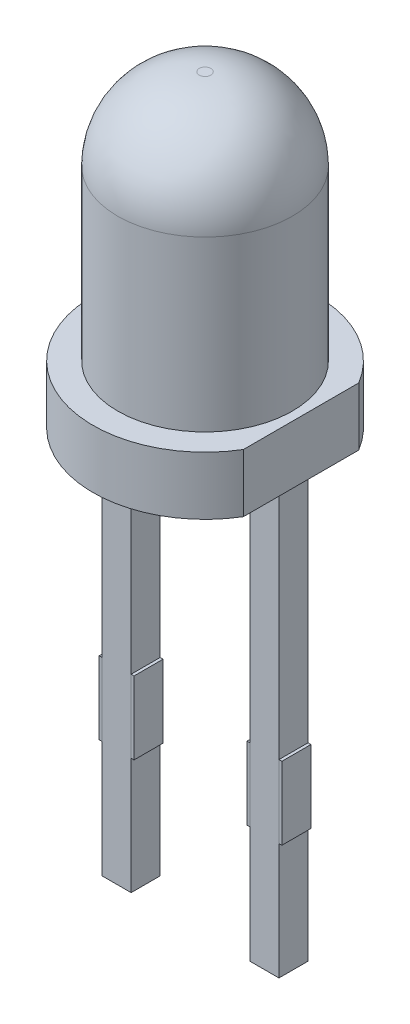
ISO-10303-21;
HEADER;
FILE_DESCRIPTION(('STEP AP214'),'2;1');
FILE_NAME('part.step','',(''),(''),'','','');
FILE_SCHEMA(('AUTOMOTIVE_DESIGN { 1 0 10303 214 1 1 1 1 }'));
ENDSEC;
DATA;
#1=APPLICATION_CONTEXT('core data for automotive mechanical design processes');
#2=APPLICATION_PROTOCOL_DEFINITION('international standard','automotive_design',2000,#1);
#3=PRODUCT_CONTEXT('',#1,'mechanical');
#4=PRODUCT('Part','Part','',(#3));
#5=PRODUCT_RELATED_PRODUCT_CATEGORY('part','',(#4));
#6=PRODUCT_DEFINITION_FORMATION('','',#4);
#7=PRODUCT_DEFINITION_CONTEXT('part definition',#1,'design');
#8=PRODUCT_DEFINITION('design','',#6,#7);
#9=PRODUCT_DEFINITION_SHAPE('','',#8);
#10=(LENGTH_UNIT() NAMED_UNIT(*) SI_UNIT(.MILLI.,.METRE.));
#11=(NAMED_UNIT(*) PLANE_ANGLE_UNIT() SI_UNIT($,.RADIAN.));
#12=(NAMED_UNIT(*) SI_UNIT($,.STERADIAN.) SOLID_ANGLE_UNIT());
#13=UNCERTAINTY_MEASURE_WITH_UNIT(LENGTH_MEASURE(1.E-05),#10,'distance_accuracy_value','');
#14=(GEOMETRIC_REPRESENTATION_CONTEXT(3) GLOBAL_UNCERTAINTY_ASSIGNED_CONTEXT((#13)) GLOBAL_UNIT_ASSIGNED_CONTEXT((#10,
#11,#12)) REPRESENTATION_CONTEXT('',''));
#15=CARTESIAN_POINT('',(0.,0.,0.));
#16=DIRECTION('',(0.,0.,1.));
#17=DIRECTION('',(1.,0.,0.));
#18=AXIS2_PLACEMENT_3D('',#15,#16,#17);
#19=CARTESIAN_POINT('',(-0.970022466230411,1.25,0.249999999999999));
#20=DIRECTION('',(0.,0.,1.));
#21=DIRECTION('',(1.,0.,0.));
#22=AXIS2_PLACEMENT_3D('',#19,#20,#21);
#23=PLANE('',#22);
#24=DIRECTION('',(1.,0.,0.));
#25=VECTOR('',#24,1.);
#26=CARTESIAN_POINT('',(-1.27002246623041,0.,0.249999999999999));
#27=LINE('',#26,#25);
#28=CARTESIAN_POINT('',(-0.970022466230411,0.,0.249999999999999));
#29=VERTEX_POINT('',#28);
#30=CARTESIAN_POINT('',(-1.57002246623041,0.,0.249999999999999));
#31=VERTEX_POINT('',#30);
#32=EDGE_CURVE('P0_E56',#29,#31,#27,.F.);
#33=ORIENTED_EDGE('',*,*,#32,.F.);
#34=DIRECTION('',(0.,1.,0.));
#35=VECTOR('',#34,1.);
#36=CARTESIAN_POINT('',(-0.970022466230411,1.25,0.249999999999999));
#37=LINE('',#36,#35);
#38=CARTESIAN_POINT('',(-0.970022466230411,1.25,0.249999999999999));
#39=VERTEX_POINT('',#38);
#40=EDGE_CURVE('P0_E68',#39,#29,#37,.F.);
#41=ORIENTED_EDGE('',*,*,#40,.F.);
#42=DIRECTION('',(-1.,0.,0.));
#43=VECTOR('',#42,1.);
#44=CARTESIAN_POINT('',(-1.27002246623041,1.25,0.249999999999999));
#45=LINE('',#44,#43);
#46=CARTESIAN_POINT('',(-1.57002246623041,1.25,0.249999999999999));
#47=VERTEX_POINT('',#46);
#48=EDGE_CURVE('P0_E21',#47,#39,#45,.F.);
#49=ORIENTED_EDGE('',*,*,#48,.F.);
#50=DIRECTION('',(0.,1.,0.));
#51=VECTOR('',#50,1.);
#52=CARTESIAN_POINT('',(-1.57002246623041,1.25,0.249999999999999));
#53=LINE('',#52,#51);
#54=EDGE_CURVE('P0_E82',#31,#47,#53,.T.);
#55=ORIENTED_EDGE('',*,*,#54,.F.);
#56=EDGE_LOOP('',(#33,#41,#49,#55));
#57=FACE_BOUND('',#56,.T.);
#58=ADVANCED_FACE('P0_F18',(#57),#23,.T.);
#59=CARTESIAN_POINT('',(-1.27002246623041,1.25,0.));
#60=DIRECTION('',(0.,1.,0.));
#61=DIRECTION('',(-1.,0.,0.));
#62=AXIS2_PLACEMENT_3D('',#59,#60,#61);
#63=PLANE('',#62);
#64=DIRECTION('',(-1.,0.,0.));
#65=VECTOR('',#64,1.);
#66=CARTESIAN_POINT('',(-1.57002246623041,1.25,-0.250000000000001));
#67=LINE('',#66,#65);
#68=CARTESIAN_POINT('',(-1.57002246623041,1.25,-0.250000000000001));
#69=VERTEX_POINT('',#68);
#70=CARTESIAN_POINT('',(-0.970022466230411,1.25,-0.250000000000001));
#71=VERTEX_POINT('',#70);
#72=EDGE_CURVE('P0_E84',#69,#71,#67,.F.);
#73=ORIENTED_EDGE('',*,*,#72,.F.);
#74=DIRECTION('',(0.,0.,1.));
#75=VECTOR('',#74,1.);
#76=CARTESIAN_POINT('',(-1.57002246623041,1.25,0.249999999999999));
#77=LINE('',#76,#75);
#78=EDGE_CURVE('P0_E66',#47,#69,#77,.F.);
#79=ORIENTED_EDGE('',*,*,#78,.F.);
#80=ORIENTED_EDGE('',*,*,#48,.T.);
#81=DIRECTION('',(0.,0.,-1.));
#82=VECTOR('',#81,1.);
#83=CARTESIAN_POINT('',(-0.970022466230411,1.25,-0.250000000000001));
#84=LINE('',#83,#82);
#85=EDGE_CURVE('P0_E63',#71,#39,#84,.F.);
#86=ORIENTED_EDGE('',*,*,#85,.F.);
#87=EDGE_LOOP('',(#73,#79,#80,#86));
#88=FACE_BOUND('',#87,.T.);
#89=ADVANCED_FACE('P0_F61',(#88),#63,.T.);
#90=CARTESIAN_POINT('',(-0.970022466230411,1.25,-0.250000000000001));
#91=DIRECTION('',(1.,0.,0.));
#92=DIRECTION('',(0.,0.,-1.));
#93=AXIS2_PLACEMENT_3D('',#90,#91,#92);
#94=PLANE('',#93);
#95=DIRECTION('',(0.,0.,1.));
#96=VECTOR('',#95,1.);
#97=CARTESIAN_POINT('',(-0.970022466230411,0.,0.));
#98=LINE('',#97,#96);
#99=CARTESIAN_POINT('',(-0.970022466230411,0.,-0.250000000000001));
#100=VERTEX_POINT('',#99);
#101=EDGE_CURVE('P0_E78',#100,#29,#98,.T.);
#102=ORIENTED_EDGE('',*,*,#101,.F.);
#103=DIRECTION('',(0.,1.,0.));
#104=VECTOR('',#103,1.);
#105=CARTESIAN_POINT('',(-0.970022466230411,1.25,-0.250000000000001));
#106=LINE('',#105,#104);
#107=EDGE_CURVE('P0_E74',#71,#100,#106,.F.);
#108=ORIENTED_EDGE('',*,*,#107,.F.);
#109=ORIENTED_EDGE('',*,*,#85,.T.);
#110=ORIENTED_EDGE('',*,*,#40,.T.);
#111=EDGE_LOOP('',(#102,#108,#109,#110));
#112=FACE_BOUND('',#111,.T.);
#113=ADVANCED_FACE('P0_F72',(#112),#94,.T.);
#114=CARTESIAN_POINT('',(-1.27002246623041,0.,0.));
#115=DIRECTION('',(0.,-1.,0.));
#116=DIRECTION('',(1.,0.,0.));
#117=AXIS2_PLACEMENT_3D('',#114,#115,#116);
#118=PLANE('',#117);
#119=DIRECTION('',(-1.,0.,0.));
#120=VECTOR('',#119,1.);
#121=CARTESIAN_POINT('',(-1.57002246623041,0.,-0.250000000000001));
#122=LINE('',#121,#120);
#123=CARTESIAN_POINT('',(-1.57002246623041,0.,-0.250000000000001));
#124=VERTEX_POINT('',#123);
#125=EDGE_CURVE('P0_E27',#100,#124,#122,.T.);
#126=ORIENTED_EDGE('',*,*,#125,.F.);
#127=ORIENTED_EDGE('',*,*,#101,.T.);
#128=ORIENTED_EDGE('',*,*,#32,.T.);
#129=DIRECTION('',(0.,0.,1.));
#130=VECTOR('',#129,1.);
#131=CARTESIAN_POINT('',(-1.57002246623041,0.,0.249999999999999));
#132=LINE('',#131,#130);
#133=EDGE_CURVE('P0_E36',#124,#31,#132,.T.);
#134=ORIENTED_EDGE('',*,*,#133,.F.);
#135=EDGE_LOOP('',(#126,#127,#128,#134));
#136=FACE_BOUND('',#135,.T.);
#137=ADVANCED_FACE('P0_F90',(#136),#118,.T.);
#138=CARTESIAN_POINT('',(-1.57002246623041,1.25,0.249999999999999));
#139=DIRECTION('',(-1.,0.,0.));
#140=DIRECTION('',(0.,0.,1.));
#141=AXIS2_PLACEMENT_3D('',#138,#139,#140);
#142=PLANE('',#141);
#143=ORIENTED_EDGE('',*,*,#133,.T.);
#144=ORIENTED_EDGE('',*,*,#54,.T.);
#145=ORIENTED_EDGE('',*,*,#78,.T.);
#146=DIRECTION('',(0.,1.,0.));
#147=VECTOR('',#146,1.);
#148=CARTESIAN_POINT('',(-1.57002246623041,1.25,-0.250000000000001));
#149=LINE('',#148,#147);
#150=EDGE_CURVE('P0_E11',#124,#69,#149,.T.);
#151=ORIENTED_EDGE('',*,*,#150,.F.);
#152=EDGE_LOOP('',(#143,#144,#145,#151));
#153=FACE_BOUND('',#152,.T.);
#154=ADVANCED_FACE('P0_F92',(#153),#142,.T.);
#155=CARTESIAN_POINT('',(-1.57002246623041,1.25,-0.250000000000001));
#156=DIRECTION('',(0.,0.,-1.));
#157=DIRECTION('',(-1.,0.,0.));
#158=AXIS2_PLACEMENT_3D('',#155,#156,#157);
#159=PLANE('',#158);
#160=ORIENTED_EDGE('',*,*,#125,.T.);
#161=ORIENTED_EDGE('',*,*,#150,.T.);
#162=ORIENTED_EDGE('',*,*,#72,.T.);
#163=ORIENTED_EDGE('',*,*,#107,.T.);
#164=EDGE_LOOP('',(#160,#161,#162,#163));
#165=FACE_BOUND('',#164,.T.);
#166=ADVANCED_FACE('P0_F89',(#165),#159,.T.);
#167=CLOSED_SHELL('',(#58,#89,#113,#137,#154,#166));
#168=MANIFOLD_SOLID_BREP('P0_B1',#167);
#169=CARTESIAN_POINT('',(1.52000005960464,5.3,0.249999999999999));
#170=DIRECTION('',(0.,0.,1.));
#171=DIRECTION('',(1.,0.,0.));
#172=AXIS2_PLACEMENT_3D('',#169,#170,#171);
#173=PLANE('',#172);
#174=DIRECTION('',(1.,0.,0.));
#175=VECTOR('',#174,1.);
#176=CARTESIAN_POINT('',(1.27000005960464,-2.,0.249999999999999));
#177=LINE('',#176,#175);
#178=CARTESIAN_POINT('',(1.52000005960464,-2.,0.249999999999999));
#179=VERTEX_POINT('',#178);
#180=CARTESIAN_POINT('',(1.02000005960464,-2.,0.249999999999999));
#181=VERTEX_POINT('',#180);
#182=EDGE_CURVE('P1_E69',#179,#181,#177,.F.);
#183=ORIENTED_EDGE('',*,*,#182,.F.);
#184=DIRECTION('',(0.,1.,0.));
#185=VECTOR('',#184,1.);
#186=CARTESIAN_POINT('',(1.52000005960464,5.3,0.249999999999999));
#187=LINE('',#186,#185);
#188=CARTESIAN_POINT('',(1.52000005960464,5.3,0.249999999999999));
#189=VERTEX_POINT('',#188);
#190=EDGE_CURVE('P1_E56',#189,#179,#187,.F.);
#191=ORIENTED_EDGE('',*,*,#190,.F.);
#192=DIRECTION('',(-1.,0.,0.));
#193=VECTOR('',#192,1.);
#194=CARTESIAN_POINT('',(1.27000005960464,5.3,0.249999999999999));
#195=LINE('',#194,#193);
#196=CARTESIAN_POINT('',(1.02000005960464,5.3,0.249999999999999));
#197=VERTEX_POINT('',#196);
#198=EDGE_CURVE('P1_E21',#197,#189,#195,.F.);
#199=ORIENTED_EDGE('',*,*,#198,.F.);
#200=DIRECTION('',(0.,1.,0.));
#201=VECTOR('',#200,1.);
#202=CARTESIAN_POINT('',(1.02000005960464,5.3,0.249999999999999));
#203=LINE('',#202,#201);
#204=EDGE_CURVE('P1_E82',#181,#197,#203,.T.);
#205=ORIENTED_EDGE('',*,*,#204,.F.);
#206=EDGE_LOOP('',(#183,#191,#199,#205));
#207=FACE_BOUND('',#206,.T.);
#208=ADVANCED_FACE('P1_F18',(#207),#173,.T.);
#209=CARTESIAN_POINT('',(1.27000005960464,5.3,0.));
#210=DIRECTION('',(0.,1.,0.));
#211=DIRECTION('',(-1.,0.,0.));
#212=AXIS2_PLACEMENT_3D('',#209,#210,#211);
#213=PLANE('',#212);
#214=DIRECTION('',(0.,0.,1.));
#215=VECTOR('',#214,1.);
#216=CARTESIAN_POINT('',(1.02000005960464,5.3,0.249999999999999));
#217=LINE('',#216,#215);
#218=CARTESIAN_POINT('',(1.02000005960464,5.3,-0.250000000000001));
#219=VERTEX_POINT('',#218);
#220=EDGE_CURVE('P1_E65',#197,#219,#217,.F.);
#221=ORIENTED_EDGE('',*,*,#220,.F.);
#222=ORIENTED_EDGE('',*,*,#198,.T.);
#223=DIRECTION('',(0.,0.,-1.));
#224=VECTOR('',#223,1.);
#225=CARTESIAN_POINT('',(1.52000005960464,5.3,-0.250000000000001));
#226=LINE('',#225,#224);
#227=CARTESIAN_POINT('',(1.52000005960464,5.3,-0.250000000000001));
#228=VERTEX_POINT('',#227);
#229=EDGE_CURVE('P1_E62',#228,#189,#226,.F.);
#230=ORIENTED_EDGE('',*,*,#229,.F.);
#231=DIRECTION('',(-1.,0.,0.));
#232=VECTOR('',#231,1.);
#233=CARTESIAN_POINT('',(1.02000005960464,5.3,-0.250000000000001));
#234=LINE('',#233,#232);
#235=EDGE_CURVE('P1_E84',#219,#228,#234,.F.);
#236=ORIENTED_EDGE('',*,*,#235,.F.);
#237=EDGE_LOOP('',(#221,#222,#230,#236));
#238=FACE_BOUND('',#237,.T.);
#239=ADVANCED_FACE('P1_F61',(#238),#213,.T.);
#240=CARTESIAN_POINT('',(1.52000005960464,5.3,-0.250000000000001));
#241=DIRECTION('',(1.,0.,0.));
#242=DIRECTION('',(0.,0.,-1.));
#243=AXIS2_PLACEMENT_3D('',#240,#241,#242);
#244=PLANE('',#243);
#245=DIRECTION('',(0.,0.,1.));
#246=VECTOR('',#245,1.);
#247=CARTESIAN_POINT('',(1.52000005960464,-2.,0.));
#248=LINE('',#247,#246);
#249=CARTESIAN_POINT('',(1.52000005960464,-2.,-0.250000000000001));
#250=VERTEX_POINT('',#249);
#251=EDGE_CURVE('P1_E71',#250,#179,#248,.T.);
#252=ORIENTED_EDGE('',*,*,#251,.F.);
#253=DIRECTION('',(0.,1.,0.));
#254=VECTOR('',#253,1.);
#255=CARTESIAN_POINT('',(1.52000005960464,5.3,-0.250000000000001));
#256=LINE('',#255,#254);
#257=EDGE_CURVE('P1_E75',#228,#250,#256,.F.);
#258=ORIENTED_EDGE('',*,*,#257,.F.);
#259=ORIENTED_EDGE('',*,*,#229,.T.);
#260=ORIENTED_EDGE('',*,*,#190,.T.);
#261=EDGE_LOOP('',(#252,#258,#259,#260));
#262=FACE_BOUND('',#261,.T.);
#263=ADVANCED_FACE('P1_F73',(#262),#244,.T.);
#264=CARTESIAN_POINT('',(1.27000005960464,-2.,0.));
#265=DIRECTION('',(0.,-1.,0.));
#266=DIRECTION('',(1.,0.,0.));
#267=AXIS2_PLACEMENT_3D('',#264,#265,#266);
#268=PLANE('',#267);
#269=DIRECTION('',(0.,0.,1.));
#270=VECTOR('',#269,1.);
#271=CARTESIAN_POINT('',(1.02000005960464,-2.,0.249999999999999));
#272=LINE('',#271,#270);
#273=CARTESIAN_POINT('',(1.02000005960464,-2.,-0.250000000000001));
#274=VERTEX_POINT('',#273);
#275=EDGE_CURVE('P1_E36',#274,#181,#272,.T.);
#276=ORIENTED_EDGE('',*,*,#275,.F.);
#277=DIRECTION('',(-1.,0.,0.));
#278=VECTOR('',#277,1.);
#279=CARTESIAN_POINT('',(1.02000005960464,-2.,-0.250000000000001));
#280=LINE('',#279,#278);
#281=EDGE_CURVE('P1_E27',#250,#274,#280,.T.);
#282=ORIENTED_EDGE('',*,*,#281,.F.);
#283=ORIENTED_EDGE('',*,*,#251,.T.);
#284=ORIENTED_EDGE('',*,*,#182,.T.);
#285=EDGE_LOOP('',(#276,#282,#283,#284));
#286=FACE_BOUND('',#285,.T.);
#287=ADVANCED_FACE('P1_F90',(#286),#268,.T.);
#288=CARTESIAN_POINT('',(1.02000005960464,5.3,0.249999999999999));
#289=DIRECTION('',(-1.,0.,0.));
#290=DIRECTION('',(0.,0.,1.));
#291=AXIS2_PLACEMENT_3D('',#288,#289,#290);
#292=PLANE('',#291);
#293=ORIENTED_EDGE('',*,*,#275,.T.);
#294=ORIENTED_EDGE('',*,*,#204,.T.);
#295=ORIENTED_EDGE('',*,*,#220,.T.);
#296=DIRECTION('',(0.,1.,0.));
#297=VECTOR('',#296,1.);
#298=CARTESIAN_POINT('',(1.02000005960464,5.3,-0.250000000000001));
#299=LINE('',#298,#297);
#300=EDGE_CURVE('P1_E11',#274,#219,#299,.T.);
#301=ORIENTED_EDGE('',*,*,#300,.F.);
#302=EDGE_LOOP('',(#293,#294,#295,#301));
#303=FACE_BOUND('',#302,.T.);
#304=ADVANCED_FACE('P1_F92',(#303),#292,.T.);
#305=CARTESIAN_POINT('',(1.02000005960464,5.3,-0.250000000000001));
#306=DIRECTION('',(0.,0.,-1.));
#307=DIRECTION('',(-1.,0.,0.));
#308=AXIS2_PLACEMENT_3D('',#305,#306,#307);
#309=PLANE('',#308);
#310=ORIENTED_EDGE('',*,*,#281,.T.);
#311=ORIENTED_EDGE('',*,*,#300,.T.);
#312=ORIENTED_EDGE('',*,*,#235,.T.);
#313=ORIENTED_EDGE('',*,*,#257,.T.);
#314=EDGE_LOOP('',(#310,#311,#312,#313));
#315=FACE_BOUND('',#314,.T.);
#316=ADVANCED_FACE('P1_F89',(#315),#309,.T.);
#317=CLOSED_SHELL('',(#208,#239,#263,#287,#304,#316));
#318=MANIFOLD_SOLID_BREP('P1_B1',#317);
#319=CARTESIAN_POINT('',(1.56997753376959,1.25,0.249999999999999));
#320=DIRECTION('',(0.,0.,1.));
#321=DIRECTION('',(1.,0.,0.));
#322=AXIS2_PLACEMENT_3D('',#319,#320,#321);
#323=PLANE('',#322);
#324=DIRECTION('',(1.,0.,0.));
#325=VECTOR('',#324,1.);
#326=CARTESIAN_POINT('',(1.26997753376959,0.,0.249999999999999));
#327=LINE('',#326,#325);
#328=CARTESIAN_POINT('',(1.56997753376959,0.,0.249999999999999));
#329=VERTEX_POINT('',#328);
#330=CARTESIAN_POINT('',(0.969977533769589,0.,0.249999999999999));
#331=VERTEX_POINT('',#330);
#332=EDGE_CURVE('P2_E69',#329,#331,#327,.F.);
#333=ORIENTED_EDGE('',*,*,#332,.F.);
#334=DIRECTION('',(0.,1.,0.));
#335=VECTOR('',#334,1.);
#336=CARTESIAN_POINT('',(1.56997753376959,1.25,0.249999999999999));
#337=LINE('',#336,#335);
#338=CARTESIAN_POINT('',(1.56997753376959,1.25,0.249999999999999));
#339=VERTEX_POINT('',#338);
#340=EDGE_CURVE('P2_E56',#339,#329,#337,.F.);
#341=ORIENTED_EDGE('',*,*,#340,.F.);
#342=DIRECTION('',(-1.,0.,0.));
#343=VECTOR('',#342,1.);
#344=CARTESIAN_POINT('',(1.26997753376959,1.25,0.249999999999999));
#345=LINE('',#344,#343);
#346=CARTESIAN_POINT('',(0.969977533769589,1.25,0.249999999999999));
#347=VERTEX_POINT('',#346);
#348=EDGE_CURVE('P2_E21',#347,#339,#345,.F.);
#349=ORIENTED_EDGE('',*,*,#348,.F.);
#350=DIRECTION('',(0.,1.,0.));
#351=VECTOR('',#350,1.);
#352=CARTESIAN_POINT('',(0.969977533769589,1.25,0.249999999999999));
#353=LINE('',#352,#351);
#354=EDGE_CURVE('P2_E82',#331,#347,#353,.T.);
#355=ORIENTED_EDGE('',*,*,#354,.F.);
#356=EDGE_LOOP('',(#333,#341,#349,#355));
#357=FACE_BOUND('',#356,.T.);
#358=ADVANCED_FACE('P2_F18',(#357),#323,.T.);
#359=CARTESIAN_POINT('',(1.26997753376959,1.25,0.));
#360=DIRECTION('',(0.,1.,0.));
#361=DIRECTION('',(-1.,0.,0.));
#362=AXIS2_PLACEMENT_3D('',#359,#360,#361);
#363=PLANE('',#362);
#364=DIRECTION('',(0.,0.,1.));
#365=VECTOR('',#364,1.);
#366=CARTESIAN_POINT('',(0.969977533769589,1.25,0.249999999999999));
#367=LINE('',#366,#365);
#368=CARTESIAN_POINT('',(0.969977533769589,1.25,-0.250000000000001));
#369=VERTEX_POINT('',#368);
#370=EDGE_CURVE('P2_E65',#347,#369,#367,.F.);
#371=ORIENTED_EDGE('',*,*,#370,.F.);
#372=ORIENTED_EDGE('',*,*,#348,.T.);
#373=DIRECTION('',(0.,0.,-1.));
#374=VECTOR('',#373,1.);
#375=CARTESIAN_POINT('',(1.56997753376959,1.25,-0.250000000000001));
#376=LINE('',#375,#374);
#377=CARTESIAN_POINT('',(1.56997753376959,1.25,-0.250000000000001));
#378=VERTEX_POINT('',#377);
#379=EDGE_CURVE('P2_E62',#378,#339,#376,.F.);
#380=ORIENTED_EDGE('',*,*,#379,.F.);
#381=DIRECTION('',(-1.,0.,0.));
#382=VECTOR('',#381,1.);
#383=CARTESIAN_POINT('',(0.969977533769589,1.25,-0.250000000000001));
#384=LINE('',#383,#382);
#385=EDGE_CURVE('P2_E84',#369,#378,#384,.F.);
#386=ORIENTED_EDGE('',*,*,#385,.F.);
#387=EDGE_LOOP('',(#371,#372,#380,#386));
#388=FACE_BOUND('',#387,.T.);
#389=ADVANCED_FACE('P2_F61',(#388),#363,.T.);
#390=CARTESIAN_POINT('',(1.56997753376959,1.25,-0.250000000000001));
#391=DIRECTION('',(1.,0.,0.));
#392=DIRECTION('',(0.,0.,-1.));
#393=AXIS2_PLACEMENT_3D('',#390,#391,#392);
#394=PLANE('',#393);
#395=DIRECTION('',(0.,0.,1.));
#396=VECTOR('',#395,1.);
#397=CARTESIAN_POINT('',(1.56997753376959,0.,0.));
#398=LINE('',#397,#396);
#399=CARTESIAN_POINT('',(1.56997753376959,0.,-0.250000000000001));
#400=VERTEX_POINT('',#399);
#401=EDGE_CURVE('P2_E71',#400,#329,#398,.T.);
#402=ORIENTED_EDGE('',*,*,#401,.F.);
#403=DIRECTION('',(0.,1.,0.));
#404=VECTOR('',#403,1.);
#405=CARTESIAN_POINT('',(1.56997753376959,1.25,-0.250000000000001));
#406=LINE('',#405,#404);
#407=EDGE_CURVE('P2_E75',#378,#400,#406,.F.);
#408=ORIENTED_EDGE('',*,*,#407,.F.);
#409=ORIENTED_EDGE('',*,*,#379,.T.);
#410=ORIENTED_EDGE('',*,*,#340,.T.);
#411=EDGE_LOOP('',(#402,#408,#409,#410));
#412=FACE_BOUND('',#411,.T.);
#413=ADVANCED_FACE('P2_F73',(#412),#394,.T.);
#414=CARTESIAN_POINT('',(1.26997753376959,0.,0.));
#415=DIRECTION('',(0.,-1.,0.));
#416=DIRECTION('',(1.,0.,0.));
#417=AXIS2_PLACEMENT_3D('',#414,#415,#416);
#418=PLANE('',#417);
#419=DIRECTION('',(0.,0.,1.));
#420=VECTOR('',#419,1.);
#421=CARTESIAN_POINT('',(0.969977533769589,0.,0.249999999999999));
#422=LINE('',#421,#420);
#423=CARTESIAN_POINT('',(0.969977533769589,0.,-0.250000000000001));
#424=VERTEX_POINT('',#423);
#425=EDGE_CURVE('P2_E36',#424,#331,#422,.T.);
#426=ORIENTED_EDGE('',*,*,#425,.F.);
#427=DIRECTION('',(-1.,0.,0.));
#428=VECTOR('',#427,1.);
#429=CARTESIAN_POINT('',(0.969977533769589,0.,-0.250000000000001));
#430=LINE('',#429,#428);
#431=EDGE_CURVE('P2_E27',#400,#424,#430,.T.);
#432=ORIENTED_EDGE('',*,*,#431,.F.);
#433=ORIENTED_EDGE('',*,*,#401,.T.);
#434=ORIENTED_EDGE('',*,*,#332,.T.);
#435=EDGE_LOOP('',(#426,#432,#433,#434));
#436=FACE_BOUND('',#435,.T.);
#437=ADVANCED_FACE('P2_F90',(#436),#418,.T.);
#438=CARTESIAN_POINT('',(0.969977533769589,1.25,0.249999999999999));
#439=DIRECTION('',(-1.,0.,0.));
#440=DIRECTION('',(0.,0.,1.));
#441=AXIS2_PLACEMENT_3D('',#438,#439,#440);
#442=PLANE('',#441);
#443=ORIENTED_EDGE('',*,*,#425,.T.);
#444=ORIENTED_EDGE('',*,*,#354,.T.);
#445=ORIENTED_EDGE('',*,*,#370,.T.);
#446=DIRECTION('',(0.,1.,0.));
#447=VECTOR('',#446,1.);
#448=CARTESIAN_POINT('',(0.969977533769589,1.25,-0.250000000000001));
#449=LINE('',#448,#447);
#450=EDGE_CURVE('P2_E11',#424,#369,#449,.T.);
#451=ORIENTED_EDGE('',*,*,#450,.F.);
#452=EDGE_LOOP('',(#443,#444,#445,#451));
#453=FACE_BOUND('',#452,.T.);
#454=ADVANCED_FACE('P2_F92',(#453),#442,.T.);
#455=CARTESIAN_POINT('',(0.969977533769589,1.25,-0.250000000000001));
#456=DIRECTION('',(0.,0.,-1.));
#457=DIRECTION('',(-1.,0.,0.));
#458=AXIS2_PLACEMENT_3D('',#455,#456,#457);
#459=PLANE('',#458);
#460=ORIENTED_EDGE('',*,*,#431,.T.);
#461=ORIENTED_EDGE('',*,*,#450,.T.);
#462=ORIENTED_EDGE('',*,*,#385,.T.);
#463=ORIENTED_EDGE('',*,*,#407,.T.);
#464=EDGE_LOOP('',(#460,#461,#462,#463));
#465=FACE_BOUND('',#464,.T.);
#466=ADVANCED_FACE('P2_F89',(#465),#459,.T.);
#467=CLOSED_SHELL('',(#358,#389,#413,#437,#454,#466));
#468=MANIFOLD_SOLID_BREP('P2_B1',#467);
#469=CARTESIAN_POINT('',(-1.01999994039536,5.3,0.249999999999999));
#470=DIRECTION('',(0.,0.,1.));
#471=DIRECTION('',(1.,0.,0.));
#472=AXIS2_PLACEMENT_3D('',#469,#470,#471);
#473=PLANE('',#472);
#474=DIRECTION('',(1.,0.,0.));
#475=VECTOR('',#474,1.);
#476=CARTESIAN_POINT('',(-1.26999994039536,-2.,0.249999999999999));
#477=LINE('',#476,#475);
#478=CARTESIAN_POINT('',(-1.01999994039536,-2.,0.249999999999999));
#479=VERTEX_POINT('',#478);
#480=CARTESIAN_POINT('',(-1.51999994039536,-2.,0.249999999999999));
#481=VERTEX_POINT('',#480);
#482=EDGE_CURVE('P3_E69',#479,#481,#477,.F.);
#483=ORIENTED_EDGE('',*,*,#482,.F.);
#484=DIRECTION('',(0.,1.,0.));
#485=VECTOR('',#484,1.);
#486=CARTESIAN_POINT('',(-1.01999994039536,5.3,0.249999999999999));
#487=LINE('',#486,#485);
#488=CARTESIAN_POINT('',(-1.01999994039536,5.3,0.249999999999999));
#489=VERTEX_POINT('',#488);
#490=EDGE_CURVE('P3_E56',#489,#479,#487,.F.);
#491=ORIENTED_EDGE('',*,*,#490,.F.);
#492=DIRECTION('',(-1.,0.,0.));
#493=VECTOR('',#492,1.);
#494=CARTESIAN_POINT('',(-1.26999994039536,5.3,0.249999999999999));
#495=LINE('',#494,#493);
#496=CARTESIAN_POINT('',(-1.51999994039536,5.3,0.249999999999999));
#497=VERTEX_POINT('',#496);
#498=EDGE_CURVE('P3_E21',#497,#489,#495,.F.);
#499=ORIENTED_EDGE('',*,*,#498,.F.);
#500=DIRECTION('',(0.,1.,0.));
#501=VECTOR('',#500,1.);
#502=CARTESIAN_POINT('',(-1.51999994039536,5.3,0.249999999999999));
#503=LINE('',#502,#501);
#504=EDGE_CURVE('P3_E82',#481,#497,#503,.T.);
#505=ORIENTED_EDGE('',*,*,#504,.F.);
#506=EDGE_LOOP('',(#483,#491,#499,#505));
#507=FACE_BOUND('',#506,.T.);
#508=ADVANCED_FACE('P3_F18',(#507),#473,.T.);
#509=CARTESIAN_POINT('',(-1.26999994039536,5.3,0.));
#510=DIRECTION('',(0.,1.,0.));
#511=DIRECTION('',(-1.,0.,0.));
#512=AXIS2_PLACEMENT_3D('',#509,#510,#511);
#513=PLANE('',#512);
#514=DIRECTION('',(0.,0.,1.));
#515=VECTOR('',#514,1.);
#516=CARTESIAN_POINT('',(-1.51999994039536,5.3,0.249999999999999));
#517=LINE('',#516,#515);
#518=CARTESIAN_POINT('',(-1.51999994039536,5.3,-0.250000000000001));
#519=VERTEX_POINT('',#518);
#520=EDGE_CURVE('P3_E65',#497,#519,#517,.F.);
#521=ORIENTED_EDGE('',*,*,#520,.F.);
#522=ORIENTED_EDGE('',*,*,#498,.T.);
#523=DIRECTION('',(0.,0.,-1.));
#524=VECTOR('',#523,1.);
#525=CARTESIAN_POINT('',(-1.01999994039536,5.3,-0.250000000000001));
#526=LINE('',#525,#524);
#527=CARTESIAN_POINT('',(-1.01999994039536,5.3,-0.250000000000001));
#528=VERTEX_POINT('',#527);
#529=EDGE_CURVE('P3_E62',#528,#489,#526,.F.);
#530=ORIENTED_EDGE('',*,*,#529,.F.);
#531=DIRECTION('',(-1.,0.,0.));
#532=VECTOR('',#531,1.);
#533=CARTESIAN_POINT('',(-1.51999994039536,5.3,-0.250000000000001));
#534=LINE('',#533,#532);
#535=EDGE_CURVE('P3_E84',#519,#528,#534,.F.);
#536=ORIENTED_EDGE('',*,*,#535,.F.);
#537=EDGE_LOOP('',(#521,#522,#530,#536));
#538=FACE_BOUND('',#537,.T.);
#539=ADVANCED_FACE('P3_F61',(#538),#513,.T.);
#540=CARTESIAN_POINT('',(-1.01999994039536,5.3,-0.250000000000001));
#541=DIRECTION('',(1.,0.,0.));
#542=DIRECTION('',(0.,0.,-1.));
#543=AXIS2_PLACEMENT_3D('',#540,#541,#542);
#544=PLANE('',#543);
#545=DIRECTION('',(0.,0.,1.));
#546=VECTOR('',#545,1.);
#547=CARTESIAN_POINT('',(-1.01999994039536,-2.,0.));
#548=LINE('',#547,#546);
#549=CARTESIAN_POINT('',(-1.01999994039536,-2.,-0.250000000000001));
#550=VERTEX_POINT('',#549);
#551=EDGE_CURVE('P3_E71',#550,#479,#548,.T.);
#552=ORIENTED_EDGE('',*,*,#551,.F.);
#553=DIRECTION('',(0.,1.,0.));
#554=VECTOR('',#553,1.);
#555=CARTESIAN_POINT('',(-1.01999994039536,5.3,-0.250000000000001));
#556=LINE('',#555,#554);
#557=EDGE_CURVE('P3_E75',#528,#550,#556,.F.);
#558=ORIENTED_EDGE('',*,*,#557,.F.);
#559=ORIENTED_EDGE('',*,*,#529,.T.);
#560=ORIENTED_EDGE('',*,*,#490,.T.);
#561=EDGE_LOOP('',(#552,#558,#559,#560));
#562=FACE_BOUND('',#561,.T.);
#563=ADVANCED_FACE('P3_F73',(#562),#544,.T.);
#564=CARTESIAN_POINT('',(-1.26999994039536,-2.,0.));
#565=DIRECTION('',(0.,-1.,0.));
#566=DIRECTION('',(1.,0.,0.));
#567=AXIS2_PLACEMENT_3D('',#564,#565,#566);
#568=PLANE('',#567);
#569=DIRECTION('',(0.,0.,1.));
#570=VECTOR('',#569,1.);
#571=CARTESIAN_POINT('',(-1.51999994039536,-2.,0.249999999999999));
#572=LINE('',#571,#570);
#573=CARTESIAN_POINT('',(-1.51999994039536,-2.,-0.250000000000001));
#574=VERTEX_POINT('',#573);
#575=EDGE_CURVE('P3_E36',#574,#481,#572,.T.);
#576=ORIENTED_EDGE('',*,*,#575,.F.);
#577=DIRECTION('',(-1.,0.,0.));
#578=VECTOR('',#577,1.);
#579=CARTESIAN_POINT('',(-1.51999994039536,-2.,-0.250000000000001));
#580=LINE('',#579,#578);
#581=EDGE_CURVE('P3_E27',#550,#574,#580,.T.);
#582=ORIENTED_EDGE('',*,*,#581,.F.);
#583=ORIENTED_EDGE('',*,*,#551,.T.);
#584=ORIENTED_EDGE('',*,*,#482,.T.);
#585=EDGE_LOOP('',(#576,#582,#583,#584));
#586=FACE_BOUND('',#585,.T.);
#587=ADVANCED_FACE('P3_F90',(#586),#568,.T.);
#588=CARTESIAN_POINT('',(-1.51999994039536,5.3,0.249999999999999));
#589=DIRECTION('',(-1.,0.,0.));
#590=DIRECTION('',(0.,0.,1.));
#591=AXIS2_PLACEMENT_3D('',#588,#589,#590);
#592=PLANE('',#591);
#593=ORIENTED_EDGE('',*,*,#575,.T.);
#594=ORIENTED_EDGE('',*,*,#504,.T.);
#595=ORIENTED_EDGE('',*,*,#520,.T.);
#596=DIRECTION('',(0.,1.,0.));
#597=VECTOR('',#596,1.);
#598=CARTESIAN_POINT('',(-1.51999994039536,5.3,-0.250000000000001));
#599=LINE('',#598,#597);
#600=EDGE_CURVE('P3_E11',#574,#519,#599,.T.);
#601=ORIENTED_EDGE('',*,*,#600,.F.);
#602=EDGE_LOOP('',(#593,#594,#595,#601));
#603=FACE_BOUND('',#602,.T.);
#604=ADVANCED_FACE('P3_F92',(#603),#592,.T.);
#605=CARTESIAN_POINT('',(-1.51999994039536,5.3,-0.250000000000001));
#606=DIRECTION('',(0.,0.,-1.));
#607=DIRECTION('',(-1.,0.,0.));
#608=AXIS2_PLACEMENT_3D('',#605,#606,#607);
#609=PLANE('',#608);
#610=ORIENTED_EDGE('',*,*,#581,.T.);
#611=ORIENTED_EDGE('',*,*,#600,.T.);
#612=ORIENTED_EDGE('',*,*,#535,.T.);
#613=ORIENTED_EDGE('',*,*,#557,.T.);
#614=EDGE_LOOP('',(#610,#611,#612,#613));
#615=FACE_BOUND('',#614,.T.);
#616=ADVANCED_FACE('P3_F89',(#615),#609,.T.);
#617=CLOSED_SHELL('',(#508,#539,#563,#587,#604,#616));
#618=MANIFOLD_SOLID_BREP('P3_B1',#617);
#619=CARTESIAN_POINT('',(0.,5.3,0.));
#620=DIRECTION('',(0.,-1.,0.));
#621=DIRECTION('',(0.,0.,-1.));
#622=AXIS2_PLACEMENT_3D('',#619,#620,#621);
#623=PLANE('',#622);
#624=DIRECTION('',(0.,0.,1.));
#625=VECTOR('',#624,1.);
#626=CARTESIAN_POINT('',(1.65025321659662,5.3,-3.00000004470348));
#627=LINE('',#626,#625);
#628=CARTESIAN_POINT('',(1.65025321659662,5.3,-0.991105100941625));
#629=VERTEX_POINT('',#628);
#630=CARTESIAN_POINT('',(1.65025321659662,5.3,0.991105100941623));
#631=VERTEX_POINT('',#630);
#632=EDGE_CURVE('P4_E51',#629,#631,#627,.T.);
#633=ORIENTED_EDGE('',*,*,#632,.T.);
#634=CARTESIAN_POINT('',(0.,5.3,0.));
#635=DIRECTION('',(0.,1.,0.));
#636=DIRECTION('',(0.,0.,1.));
#637=AXIS2_PLACEMENT_3D('',#634,#635,#636);
#638=CIRCLE('',#637,1.925);
#639=EDGE_CURVE('P4_E23',#629,#631,#638,.T.);
#640=ORIENTED_EDGE('',*,*,#639,.F.);
#641=EDGE_LOOP('',(#633,#640));
#642=FACE_BOUND('',#641,.T.);
#643=ADVANCED_FACE('P4_F19',(#642),#623,.T.);
#644=CARTESIAN_POINT('',(1.65025321659662,5.3,-3.00000004470348));
#645=DIRECTION('',(-1.,0.,0.));
#646=DIRECTION('',(0.,0.,1.));
#647=AXIS2_PLACEMENT_3D('',#644,#645,#646);
#648=PLANE('',#647);
#649=DIRECTION('',(0.,0.,1.));
#650=VECTOR('',#649,1.);
#651=CARTESIAN_POINT('',(1.65025321659662,6.3,0.));
#652=LINE('',#651,#650);
#653=CARTESIAN_POINT('',(1.65025321659662,6.3,0.991105100941622));
#654=VERTEX_POINT('',#653);
#655=CARTESIAN_POINT('',(1.65025321659662,6.3,-0.991105100941625));
#656=VERTEX_POINT('',#655);
#657=EDGE_CURVE('P4_E62',#654,#656,#652,.F.);
#658=ORIENTED_EDGE('',*,*,#657,.F.);
#659=DIRECTION('',(0.,1.,0.));
#660=VECTOR('',#659,1.);
#661=CARTESIAN_POINT('',(1.65025321659662,5.8,0.991105100941621));
#662=LINE('',#661,#660);
#663=EDGE_CURVE('P4_E59',#631,#654,#662,.T.);
#664=ORIENTED_EDGE('',*,*,#663,.F.);
#665=ORIENTED_EDGE('',*,*,#632,.F.);
#666=DIRECTION('',(0.,1.,0.));
#667=VECTOR('',#666,1.);
#668=CARTESIAN_POINT('',(1.65025321659662,5.8,-0.991105100941623));
#669=LINE('',#668,#667);
#670=EDGE_CURVE('P4_E56',#656,#629,#669,.F.);
#671=ORIENTED_EDGE('',*,*,#670,.F.);
#672=EDGE_LOOP('',(#658,#664,#665,#671));
#673=FACE_BOUND('',#672,.T.);
#674=ADVANCED_FACE('P4_F60',(#673),#648,.F.);
#675=CARTESIAN_POINT('',(0.,5.8,0.));
#676=DIRECTION('',(0.,1.,0.));
#677=DIRECTION('',(0.,0.,1.));
#678=AXIS2_PLACEMENT_3D('',#675,#676,#677);
#679=CYLINDRICAL_SURFACE('',#678,1.925);
#680=ORIENTED_EDGE('',*,*,#663,.T.);
#681=CARTESIAN_POINT('',(0.,6.3,0.));
#682=DIRECTION('',(0.,1.,0.));
#683=DIRECTION('',(0.,0.,1.));
#684=AXIS2_PLACEMENT_3D('',#681,#682,#683);
#685=CIRCLE('',#684,1.925);
#686=EDGE_CURVE('P4_E72',#656,#654,#685,.T.);
#687=ORIENTED_EDGE('',*,*,#686,.F.);
#688=ORIENTED_EDGE('',*,*,#670,.T.);
#689=ORIENTED_EDGE('',*,*,#639,.T.);
#690=EDGE_LOOP('',(#680,#687,#688,#689));
#691=FACE_BOUND('',#690,.T.);
#692=ADVANCED_FACE('P4_F67',(#691),#679,.T.);
#693=CARTESIAN_POINT('',(0.,10.6,0.));
#694=DIRECTION('',(0.,1.,0.));
#695=DIRECTION('',(0.,0.,1.));
#696=AXIS2_PLACEMENT_3D('',#693,#694,#695);
#697=PLANE('',#696);
#698=CARTESIAN_POINT('',(0.,10.6,0.));
#699=DIRECTION('',(0.,1.,0.));
#700=DIRECTION('',(0.,0.,1.));
#701=AXIS2_PLACEMENT_3D('',#698,#699,#700);
#702=CIRCLE('',#701,0.0999999999999999);
#703=CARTESIAN_POINT('',(0.,10.6,-0.100000000000003));
#704=VERTEX_POINT('',#703);
#705=CARTESIAN_POINT('',(0.0999999999999999,10.6,0.));
#706=VERTEX_POINT('',#705);
#707=EDGE_CURVE('P4_E37',#704,#706,#702,.T.);
#708=ORIENTED_EDGE('',*,*,#707,.T.);
#709=CARTESIAN_POINT('',(0.1,10.6,0.));
#710=CARTESIAN_POINT('',(0.1,10.6,-0.0408974612727251));
#711=CARTESIAN_POINT('',(0.0707106781186548,10.6,-0.0707106781186573));
#712=CARTESIAN_POINT('',(0.041936045018768,10.6,-0.100000000000003));
#713=CARTESIAN_POINT('',(0.,10.6,-0.100000000000003));
#714=B_SPLINE_CURVE_WITH_KNOTS('',2,(#709,#710,#711,#712,#713),.UNSPECIFIED.,.F.,.F.,(3,2,3),
(0.,0.5,1.),.UNSPECIFIED.);
#715=EDGE_CURVE('P4_E71',#706,#704,#714,.T.);
#716=ORIENTED_EDGE('',*,*,#715,.T.);
#717=EDGE_LOOP('',(#708,#716));
#718=FACE_BOUND('',#717,.T.);
#719=ADVANCED_FACE('P4_F80',(#718),#697,.T.);
#720=CARTESIAN_POINT('',(0.,6.3,0.));
#721=DIRECTION('',(0.,1.,0.));
#722=DIRECTION('',(0.,0.,1.));
#723=AXIS2_PLACEMENT_3D('',#720,#721,#722);
#724=PLANE('',#723);
#725=CARTESIAN_POINT('',(0.,6.3,0.));
#726=DIRECTION('',(0.,1.,0.));
#727=DIRECTION('',(0.,0.,1.));
#728=AXIS2_PLACEMENT_3D('',#725,#726,#727);
#729=CIRCLE('',#728,1.5);
#730=CARTESIAN_POINT('',(0.,6.3,1.5));
#731=VERTEX_POINT('',#730);
#732=EDGE_CURVE('P4_E11',#731,#731,#729,.T.);
#733=ORIENTED_EDGE('',*,*,#732,.F.);
#734=EDGE_LOOP('',(#733));
#735=FACE_BOUND('',#734,.T.);
#736=ORIENTED_EDGE('',*,*,#657,.T.);
#737=ORIENTED_EDGE('',*,*,#686,.T.);
#738=EDGE_LOOP('',(#736,#737));
#739=FACE_BOUND('',#738,.T.);
#740=ADVANCED_FACE('P4_F90',(#735,#739),#724,.T.);
#741=CARTESIAN_POINT('',(0.,9.2,0.));
#742=DIRECTION('',(0.,1.,0.));
#743=DIRECTION('',(0.,0.,1.));
#744=AXIS2_PLACEMENT_3D('',#741,#742,#743);
#745=DEGENERATE_TOROIDAL_SURFACE('',#744,0.100000000000001,1.4,.T.);
#746=CARTESIAN_POINT('',(0.,9.2,0.));
#747=DIRECTION('',(0.,1.,0.));
#748=DIRECTION('',(0.,0.,1.));
#749=AXIS2_PLACEMENT_3D('',#746,#747,#748);
#750=CIRCLE('',#749,1.5);
#751=CARTESIAN_POINT('',(0.,9.2,1.5));
#752=VERTEX_POINT('',#751);
#753=EDGE_CURVE('P4_E29',#752,#752,#750,.F.);
#754=ORIENTED_EDGE('',*,*,#753,.F.);
#755=EDGE_LOOP('',(#754));
#756=FACE_BOUND('',#755,.T.);
#757=ORIENTED_EDGE('',*,*,#707,.F.);
#758=ORIENTED_EDGE('',*,*,#715,.F.);
#759=EDGE_LOOP('',(#757,#758));
#760=FACE_BOUND('',#759,.T.);
#761=ADVANCED_FACE('P4_F21',(#756,#760),#745,.T.);
#762=CARTESIAN_POINT('',(0.,7.95,0.));
#763=DIRECTION('',(0.,1.,0.));
#764=DIRECTION('',(0.,0.,1.));
#765=AXIS2_PLACEMENT_3D('',#762,#763,#764);
#766=CYLINDRICAL_SURFACE('',#765,1.5);
#767=ORIENTED_EDGE('',*,*,#732,.T.);
#768=EDGE_LOOP('',(#767));
#769=FACE_BOUND('',#768,.T.);
#770=ORIENTED_EDGE('',*,*,#753,.T.);
#771=EDGE_LOOP('',(#770));
#772=FACE_BOUND('',#771,.T.);
#773=ADVANCED_FACE('P4_F99',(#769,#772),#766,.T.);
#774=CLOSED_SHELL('',(#643,#674,#692,#719,#740,#761,#773));
#775=MANIFOLD_SOLID_BREP('P4_B1',#774);
#776=ADVANCED_BREP_SHAPE_REPRESENTATION('',(#18,#168,#318,#468,#618,#775),#14);
#777=SHAPE_DEFINITION_REPRESENTATION(#9,#776);
ENDSEC;
END-ISO-10303-21;
